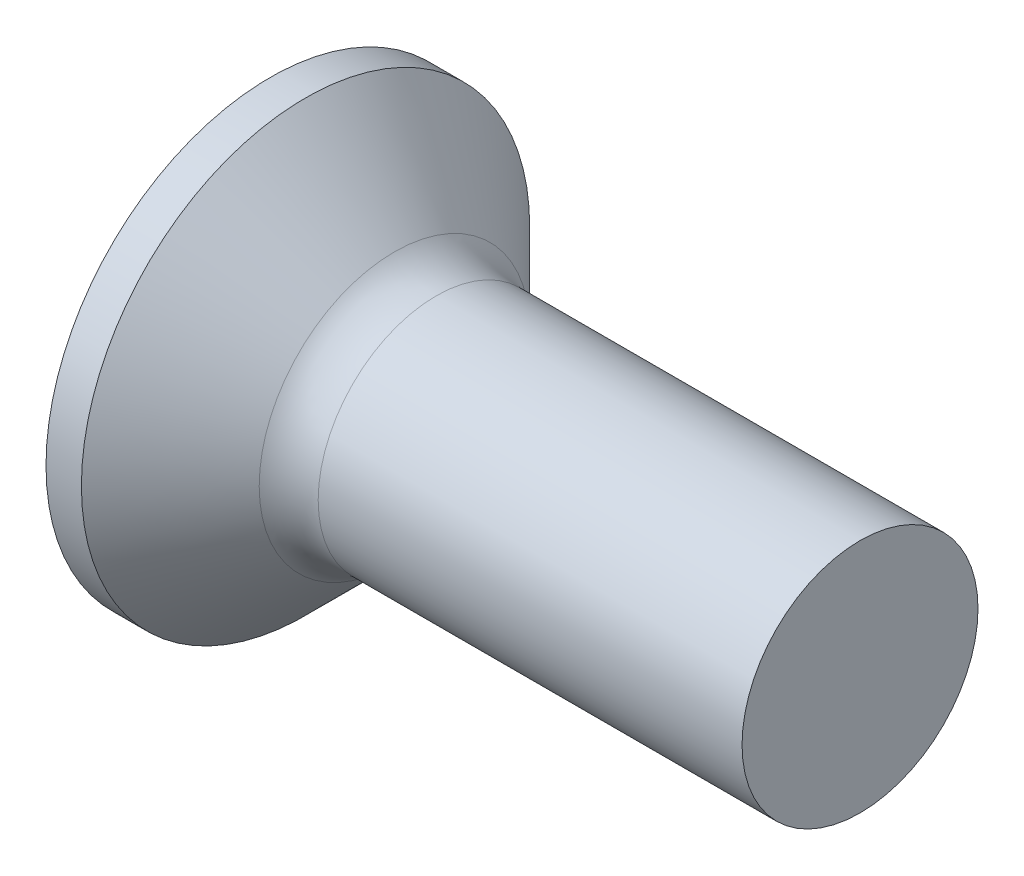
ISO-10303-21;
HEADER;
FILE_DESCRIPTION(('STEP AP214'),'2;1');
FILE_NAME('part.step','',(''),(''),'','','');
FILE_SCHEMA(('AUTOMOTIVE_DESIGN { 1 0 10303 214 1 1 1 1 }'));
ENDSEC;
DATA;
#1=APPLICATION_CONTEXT('core data for automotive mechanical design processes');
#2=APPLICATION_PROTOCOL_DEFINITION('international standard','automotive_design',2000,#1);
#3=PRODUCT_CONTEXT('',#1,'mechanical');
#4=PRODUCT('Part','Part','',(#3));
#5=PRODUCT_RELATED_PRODUCT_CATEGORY('part','',(#4));
#6=PRODUCT_DEFINITION_FORMATION('','',#4);
#7=PRODUCT_DEFINITION_CONTEXT('part definition',#1,'design');
#8=PRODUCT_DEFINITION('design','',#6,#7);
#9=PRODUCT_DEFINITION_SHAPE('','',#8);
#10=(LENGTH_UNIT() NAMED_UNIT(*) SI_UNIT(.MILLI.,.METRE.));
#11=(NAMED_UNIT(*) PLANE_ANGLE_UNIT() SI_UNIT($,.RADIAN.));
#12=(NAMED_UNIT(*) SI_UNIT($,.STERADIAN.) SOLID_ANGLE_UNIT());
#13=UNCERTAINTY_MEASURE_WITH_UNIT(LENGTH_MEASURE(1.E-05),#10,'distance_accuracy_value','');
#14=(GEOMETRIC_REPRESENTATION_CONTEXT(3) GLOBAL_UNCERTAINTY_ASSIGNED_CONTEXT((#13)) GLOBAL_UNIT_ASSIGNED_CONTEXT((#10,
#11,#12)) REPRESENTATION_CONTEXT('',''));
#15=CARTESIAN_POINT('',(0.,0.,0.));
#16=DIRECTION('',(0.,0.,1.));
#17=DIRECTION('',(1.,0.,0.));
#18=AXIS2_PLACEMENT_3D('',#15,#16,#17);
#19=CARTESIAN_POINT('',(0.,0.,0.));
#20=DIRECTION('',(-1.,0.,0.));
#21=DIRECTION('',(0.,0.,1.));
#22=AXIS2_PLACEMENT_3D('',#19,#20,#21);
#23=PLANE('',#22);
#24=CARTESIAN_POINT('',(0.,0.,0.));
#25=DIRECTION('',(-1.,0.,0.));
#26=DIRECTION('',(0.,0.,1.));
#27=AXIS2_PLACEMENT_3D('',#24,#25,#26);
#28=CIRCLE('',#27,1.9);
#29=CARTESIAN_POINT('',(0.,0.,1.9));
#30=VERTEX_POINT('',#29);
#31=EDGE_CURVE('E350',#30,#30,#28,.T.);
#32=ORIENTED_EDGE('',*,*,#31,.T.);
#33=EDGE_LOOP('',(#32));
#34=FACE_BOUND('',#33,.T.);
#35=DIRECTION('',(0.,0.,-1.));
#36=VECTOR('',#35,1.);
#37=CARTESIAN_POINT('',(0.,-0.240000000000003,0.949999999999999));
#38=LINE('',#37,#36);
#39=CARTESIAN_POINT('',(0.,-0.240000000000003,0.949999999999999));
#40=VERTEX_POINT('',#39);
#41=CARTESIAN_POINT('',(0.,-0.240000000000001,0.368080234393744));
#42=VERTEX_POINT('',#41);
#43=EDGE_CURVE('E388',#40,#42,#38,.T.);
#44=ORIENTED_EDGE('',*,*,#43,.T.);
#45=CARTESIAN_POINT('',(0.,0.,0.));
#46=DIRECTION('',(-1.,0.,0.));
#47=DIRECTION('',(0.,0.,1.));
#48=AXIS2_PLACEMENT_3D('',#45,#46,#47);
#49=CIRCLE('',#48,0.439412174332203);
#50=CARTESIAN_POINT('',(0.,-0.368080234393745,0.24));
#51=VERTEX_POINT('',#50);
#52=EDGE_CURVE('E376',#51,#42,#49,.T.);
#53=ORIENTED_EDGE('',*,*,#52,.F.);
#54=DIRECTION('',(0.,-1.,0.));
#55=VECTOR('',#54,1.);
#56=CARTESIAN_POINT('',(0.,0.95,0.24));
#57=LINE('',#56,#55);
#58=CARTESIAN_POINT('',(0.,-0.95,0.24));
#59=VERTEX_POINT('',#58);
#60=EDGE_CURVE('E435',#51,#59,#57,.T.);
#61=ORIENTED_EDGE('',*,*,#60,.T.);
#62=DIRECTION('',(0.,0.,-1.));
#63=VECTOR('',#62,1.);
#64=CARTESIAN_POINT('',(0.,-0.95,0.24));
#65=LINE('',#64,#63);
#66=CARTESIAN_POINT('',(0.,-0.95,-0.24));
#67=VERTEX_POINT('',#66);
#68=EDGE_CURVE('E347',#59,#67,#65,.T.);
#69=ORIENTED_EDGE('',*,*,#68,.T.);
#70=DIRECTION('',(0.,1.,0.));
#71=VECTOR('',#70,1.);
#72=CARTESIAN_POINT('',(0.,-0.95,-0.24));
#73=LINE('',#72,#71);
#74=CARTESIAN_POINT('',(0.,-0.368080234393745,-0.24));
#75=VERTEX_POINT('',#74);
#76=EDGE_CURVE('E436',#67,#75,#73,.T.);
#77=ORIENTED_EDGE('',*,*,#76,.T.);
#78=CARTESIAN_POINT('',(0.,-0.239999999999999,-0.368080234393746));
#79=VERTEX_POINT('',#78);
#80=EDGE_CURVE('E382',#79,#75,#49,.T.);
#81=ORIENTED_EDGE('',*,*,#80,.F.);
#82=CARTESIAN_POINT('',(0.,-0.239999999999997,-0.950000000000001));
#83=VERTEX_POINT('',#82);
#84=EDGE_CURVE('E397',#79,#83,#38,.T.);
#85=ORIENTED_EDGE('',*,*,#84,.T.);
#86=DIRECTION('',(0.,1.,0.));
#87=VECTOR('',#86,1.);
#88=CARTESIAN_POINT('',(0.,-0.239999999999997,-0.950000000000001));
#89=LINE('',#88,#87);
#90=CARTESIAN_POINT('',(0.,0.240000000000003,-0.949999999999999));
#91=VERTEX_POINT('',#90);
#92=EDGE_CURVE('E396',#83,#91,#89,.T.);
#93=ORIENTED_EDGE('',*,*,#92,.T.);
#94=DIRECTION('',(0.,0.,1.));
#95=VECTOR('',#94,1.);
#96=CARTESIAN_POINT('',(0.,0.240000000000003,-0.949999999999999));
#97=LINE('',#96,#95);
#98=CARTESIAN_POINT('',(0.,0.240000000000001,-0.368080234393745));
#99=VERTEX_POINT('',#98);
#100=EDGE_CURVE('E403',#91,#99,#97,.T.);
#101=ORIENTED_EDGE('',*,*,#100,.T.);
#102=CARTESIAN_POINT('',(0.,0.368080234393745,-0.24));
#103=VERTEX_POINT('',#102);
#104=EDGE_CURVE('E470',#103,#99,#49,.T.);
#105=ORIENTED_EDGE('',*,*,#104,.F.);
#106=CARTESIAN_POINT('',(0.,0.95,-0.24));
#107=VERTEX_POINT('',#106);
#108=EDGE_CURVE('E444',#103,#107,#73,.T.);
#109=ORIENTED_EDGE('',*,*,#108,.T.);
#110=DIRECTION('',(0.,0.,1.));
#111=VECTOR('',#110,1.);
#112=CARTESIAN_POINT('',(0.,0.95,-0.24));
#113=LINE('',#112,#111);
#114=CARTESIAN_POINT('',(0.,0.95,0.24));
#115=VERTEX_POINT('',#114);
#116=EDGE_CURVE('E432',#107,#115,#113,.T.);
#117=ORIENTED_EDGE('',*,*,#116,.T.);
#118=CARTESIAN_POINT('',(0.,0.368080234393745,0.24));
#119=VERTEX_POINT('',#118);
#120=EDGE_CURVE('E437',#115,#119,#57,.T.);
#121=ORIENTED_EDGE('',*,*,#120,.T.);
#122=CARTESIAN_POINT('',(0.,0.239999999999998,0.368080234393746));
#123=VERTEX_POINT('',#122);
#124=EDGE_CURVE('E384',#123,#119,#49,.T.);
#125=ORIENTED_EDGE('',*,*,#124,.F.);
#126=CARTESIAN_POINT('',(0.,0.239999999999996,0.950000000000001));
#127=VERTEX_POINT('',#126);
#128=EDGE_CURVE('E406',#123,#127,#97,.T.);
#129=ORIENTED_EDGE('',*,*,#128,.T.);
#130=DIRECTION('',(0.,-1.,0.));
#131=VECTOR('',#130,1.);
#132=CARTESIAN_POINT('',(0.,0.239999999999996,0.950000000000001));
#133=LINE('',#132,#131);
#134=EDGE_CURVE('E395',#127,#40,#133,.T.);
#135=ORIENTED_EDGE('',*,*,#134,.T.);
#136=EDGE_LOOP('',(#44,#53,#61,#69,#77,#81,#85,#93,#101,#105,#109,#117,#121,#125,#129,#135));
#137=FACE_BOUND('',#136,.T.);
#138=ADVANCED_FACE('F39',(#34,#137),#23,.T.);
#139=CARTESIAN_POINT('',(1.2,-0.351702090980209,0.24));
#140=DIRECTION('',(0.,0.,-1.));
#141=DIRECTION('',(-1.,0.,0.));
#142=AXIS2_PLACEMENT_3D('',#139,#140,#141);
#143=PLANE('',#142);
#144=ORIENTED_EDGE('',*,*,#60,.F.);
#145=CARTESIAN_POINT('',(-0.647693210421637,-0.421114336989891,0.24));
#146=CARTESIAN_POINT('',(-0.514503449539821,-0.410390261082994,0.24));
#147=CARTESIAN_POINT('',(-0.381320940230654,-0.399574318210381,0.24));
#148=CARTESIAN_POINT('',(-0.114973765657541,-0.377686644384344,0.24));
#149=CARTESIAN_POINT('',(0.0181908991048063,-0.366614907333784,0.24));
#150=CARTESIAN_POINT('',(0.284492634007954,-0.344144100394554,0.24));
#151=CARTESIAN_POINT('',(0.417629704159725,-0.332745030636282,0.24));
#152=CARTESIAN_POINT('',(0.683863247577946,-0.309504122508031,0.24));
#153=CARTESIAN_POINT('',(0.816959721458451,-0.297662291208049,0.24));
#154=CARTESIAN_POINT('',(1.04303435438055,-0.277010154534467,0.24));
#155=CARTESIAN_POINT('',(1.13602713245195,-0.268360479226192,0.24));
#156=CARTESIAN_POINT('',(1.32197255819723,-0.250648380041589,0.24));
#157=CARTESIAN_POINT('',(1.41492520622595,-0.241585959893611,0.24));
#158=CARTESIAN_POINT('',(1.60078125425266,-0.222904447218473,0.24));
#159=CARTESIAN_POINT('',(1.69368465086432,-0.213285320435301,0.24));
#160=CARTESIAN_POINT('',(1.87939874419459,-0.193166747195665,0.24));
#161=CARTESIAN_POINT('',(1.97220943766423,-0.182667270910301,0.24));
#162=CARTESIAN_POINT('',(2.0649517678624,-0.171565852393331,0.24));
#163=B_SPLINE_CURVE_WITH_KNOTS('',3,(#145,#146,#147,#148,#149,#150,#151,#152,#153,#154,#155,
#156,#157,#158,#159,#160,#161,#162),.UNSPECIFIED.,.F.,.F.,(4,2,2,2,2,2,2,2,4),(0.,
0.400862588724007,0.801734742325293,1.2026067362345,1.60347233177046,1.88365413960954,
2.16383341704974,2.44402995322111,2.72423598713696),.UNSPECIFIED.);
#164=CARTESIAN_POINT('',(1.2,-0.262259890185288,0.240000000000001));
#165=VERTEX_POINT('',#164);
#166=EDGE_CURVE('E379',#51,#165,#163,.T.);
#167=ORIENTED_EDGE('',*,*,#166,.T.);
#168=DIRECTION('',(0.,-1.,0.));
#169=VECTOR('',#168,1.);
#170=CARTESIAN_POINT('',(1.2,0.351702090980209,0.24));
#171=LINE('',#170,#169);
#172=CARTESIAN_POINT('',(1.2,-0.351702090980209,0.24));
#173=VERTEX_POINT('',#172);
#174=EDGE_CURVE('E451',#165,#173,#171,.T.);
#175=ORIENTED_EDGE('',*,*,#174,.T.);
#176=DIRECTION('',(0.89493436774996,0.446197800778958,0.));
#177=VECTOR('',#176,1.);
#178=CARTESIAN_POINT('',(0.,-0.95,0.24));
#179=LINE('',#178,#177);
#180=EDGE_CURVE('E325',#59,#173,#179,.T.);
#181=ORIENTED_EDGE('',*,*,#180,.F.);
#182=EDGE_LOOP('',(#144,#167,#175,#181));
#183=FACE_BOUND('',#182,.T.);
#184=ADVANCED_FACE('F193',(#183),#143,.T.);
#185=CARTESIAN_POINT('',(1.2,0.351702090980209,0.24));
#186=VERTEX_POINT('',#185);
#187=CARTESIAN_POINT('',(1.2,0.262259890185288,0.240000000000001));
#188=VERTEX_POINT('',#187);
#189=EDGE_CURVE('E334',#186,#188,#171,.T.);
#190=ORIENTED_EDGE('',*,*,#189,.T.);
#191=CARTESIAN_POINT('',(-0.647693210421637,0.421114336989891,0.24));
#192=CARTESIAN_POINT('',(-0.514503449539821,0.410390261082994,0.24));
#193=CARTESIAN_POINT('',(-0.381320940230654,0.399574318210381,0.24));
#194=CARTESIAN_POINT('',(-0.114973765657541,0.377686644384344,0.24));
#195=CARTESIAN_POINT('',(0.0181908991048065,0.366614907333784,0.24));
#196=CARTESIAN_POINT('',(0.284492634007954,0.344144100394554,0.24));
#197=CARTESIAN_POINT('',(0.417629704159725,0.332745030636282,0.24));
#198=CARTESIAN_POINT('',(0.683863247577946,0.309504122508032,0.24));
#199=CARTESIAN_POINT('',(0.816959721458451,0.297662291208049,0.24));
#200=CARTESIAN_POINT('',(1.04303435438055,0.277010154534467,0.24));
#201=CARTESIAN_POINT('',(1.13602713245196,0.268360479226192,0.24));
#202=CARTESIAN_POINT('',(1.32197255819723,0.250648380041589,0.24));
#203=CARTESIAN_POINT('',(1.41492520622595,0.241585959893611,0.24));
#204=CARTESIAN_POINT('',(1.60078125425266,0.222904447218473,0.24));
#205=CARTESIAN_POINT('',(1.69368465086432,0.213285320435301,0.24));
#206=CARTESIAN_POINT('',(1.87939874419459,0.193166747195665,0.24));
#207=CARTESIAN_POINT('',(1.97220943766423,0.182667270910301,0.24));
#208=CARTESIAN_POINT('',(2.0649517678624,0.171565852393331,0.24));
#209=B_SPLINE_CURVE_WITH_KNOTS('',3,(#191,#192,#193,#194,#195,#196,#197,#198,#199,#200,#201,
#202,#203,#204,#205,#206,#207,#208),.UNSPECIFIED.,.F.,.F.,(4,2,2,2,2,2,2,2,4),(0.,
0.400862588724007,0.801734742325293,1.2026067362345,1.60347233177046,1.88365413960954,
2.16383341704974,2.44402995322111,2.72423598713696),.UNSPECIFIED.);
#210=EDGE_CURVE('E253',#188,#119,#209,.F.);
#211=ORIENTED_EDGE('',*,*,#210,.T.);
#212=ORIENTED_EDGE('',*,*,#120,.F.);
#213=DIRECTION('',(0.89493436774996,-0.446197800778958,0.));
#214=VECTOR('',#213,1.);
#215=CARTESIAN_POINT('',(0.,0.95,0.24));
#216=LINE('',#215,#214);
#217=EDGE_CURVE('E62',#115,#186,#216,.T.);
#218=ORIENTED_EDGE('',*,*,#217,.T.);
#219=EDGE_LOOP('',(#190,#211,#212,#218));
#220=FACE_BOUND('',#219,.T.);
#221=ADVANCED_FACE('F198',(#220),#143,.T.);
#222=CARTESIAN_POINT('',(1.2,0.351702090980209,-0.24));
#223=DIRECTION('',(0.,0.,1.));
#224=DIRECTION('',(1.,0.,0.));
#225=AXIS2_PLACEMENT_3D('',#222,#223,#224);
#226=PLANE('',#225);
#227=DIRECTION('',(0.,1.,0.));
#228=VECTOR('',#227,1.);
#229=CARTESIAN_POINT('',(1.2,-0.351702090980209,-0.24));
#230=LINE('',#229,#228);
#231=CARTESIAN_POINT('',(1.2,-0.351702090980209,-0.24));
#232=VERTEX_POINT('',#231);
#233=CARTESIAN_POINT('',(1.2,-0.262259890185288,-0.24));
#234=VERTEX_POINT('',#233);
#235=EDGE_CURVE('E338',#232,#234,#230,.T.);
#236=ORIENTED_EDGE('',*,*,#235,.T.);
#237=CARTESIAN_POINT('',(-0.647693210421637,-0.421114336989891,-0.239999999999999));
#238=CARTESIAN_POINT('',(-0.514503449539821,-0.410390261082994,-0.24));
#239=CARTESIAN_POINT('',(-0.381320940230654,-0.399574318210381,-0.24));
#240=CARTESIAN_POINT('',(-0.114973765657541,-0.377686644384344,-0.24));
#241=CARTESIAN_POINT('',(0.0181908991048066,-0.366614907333785,-0.24));
#242=CARTESIAN_POINT('',(0.284492634007954,-0.344144100394554,-0.24));
#243=CARTESIAN_POINT('',(0.417629704159725,-0.332745030636282,-0.24));
#244=CARTESIAN_POINT('',(0.683863247577946,-0.309504122508032,-0.24));
#245=CARTESIAN_POINT('',(0.816959721458451,-0.297662291208049,-0.24));
#246=CARTESIAN_POINT('',(1.04303435438055,-0.277010154534467,-0.24));
#247=CARTESIAN_POINT('',(1.13602713245196,-0.268360479226193,-0.24));
#248=CARTESIAN_POINT('',(1.32197255819723,-0.250648380041589,-0.24));
#249=CARTESIAN_POINT('',(1.41492520622595,-0.241585959893612,-0.24));
#250=CARTESIAN_POINT('',(1.60078125425266,-0.222904447218473,-0.24));
#251=CARTESIAN_POINT('',(1.69368465086432,-0.213285320435301,-0.24));
#252=CARTESIAN_POINT('',(1.87939874419459,-0.193166747195665,-0.24));
#253=CARTESIAN_POINT('',(1.97220943766423,-0.182667270910301,-0.24));
#254=CARTESIAN_POINT('',(2.0649517678624,-0.171565852393331,-0.24));
#255=B_SPLINE_CURVE_WITH_KNOTS('',3,(#237,#238,#239,#240,#241,#242,#243,#244,#245,#246,#247,
#248,#249,#250,#251,#252,#253,#254),.UNSPECIFIED.,.F.,.F.,(4,2,2,2,2,2,2,2,4),(0.,
0.400862588724007,0.801734742325293,1.2026067362345,1.60347233177046,1.88365413960954,
2.16383341704974,2.44402995322111,2.72423598713696),.UNSPECIFIED.);
#256=EDGE_CURVE('E247',#234,#75,#255,.F.);
#257=ORIENTED_EDGE('',*,*,#256,.T.);
#258=ORIENTED_EDGE('',*,*,#76,.F.);
#259=DIRECTION('',(0.89493436774996,0.446197800778958,0.));
#260=VECTOR('',#259,1.);
#261=CARTESIAN_POINT('',(0.,-0.95,-0.24));
#262=LINE('',#261,#260);
#263=EDGE_CURVE('E446',#67,#232,#262,.T.);
#264=ORIENTED_EDGE('',*,*,#263,.T.);
#265=EDGE_LOOP('',(#236,#257,#258,#264));
#266=FACE_BOUND('',#265,.T.);
#267=ADVANCED_FACE('F233',(#266),#226,.T.);
#268=ORIENTED_EDGE('',*,*,#108,.F.);
#269=CARTESIAN_POINT('',(-0.647693210421637,0.421114336989891,-0.239999999999999));
#270=CARTESIAN_POINT('',(-0.514503449539821,0.410390261082994,-0.24));
#271=CARTESIAN_POINT('',(-0.381320940230654,0.399574318210381,-0.24));
#272=CARTESIAN_POINT('',(-0.114973765657541,0.377686644384344,-0.24));
#273=CARTESIAN_POINT('',(0.0181908991048066,0.366614907333785,-0.24));
#274=CARTESIAN_POINT('',(0.284492634007954,0.344144100394554,-0.24));
#275=CARTESIAN_POINT('',(0.417629704159725,0.332745030636282,-0.24));
#276=CARTESIAN_POINT('',(0.683863247577946,0.309504122508032,-0.24));
#277=CARTESIAN_POINT('',(0.816959721458451,0.297662291208049,-0.24));
#278=CARTESIAN_POINT('',(1.04303435438055,0.277010154534467,-0.24));
#279=CARTESIAN_POINT('',(1.13602713245196,0.268360479226193,-0.24));
#280=CARTESIAN_POINT('',(1.32197255819723,0.250648380041589,-0.24));
#281=CARTESIAN_POINT('',(1.41492520622595,0.241585959893612,-0.24));
#282=CARTESIAN_POINT('',(1.60078125425266,0.222904447218473,-0.24));
#283=CARTESIAN_POINT('',(1.69368465086432,0.213285320435301,-0.24));
#284=CARTESIAN_POINT('',(1.87939874419459,0.193166747195665,-0.24));
#285=CARTESIAN_POINT('',(1.97220943766423,0.182667270910302,-0.24));
#286=CARTESIAN_POINT('',(2.0649517678624,0.171565852393331,-0.24));
#287=B_SPLINE_CURVE_WITH_KNOTS('',3,(#269,#270,#271,#272,#273,#274,#275,#276,#277,#278,#279,
#280,#281,#282,#283,#284,#285,#286),.UNSPECIFIED.,.F.,.F.,(4,2,2,2,2,2,2,2,4),(0.,
0.400862588724007,0.801734742325293,1.2026067362345,1.60347233177046,1.88365413960954,
2.16383341704974,2.44402995322111,2.72423598713696),.UNSPECIFIED.);
#288=CARTESIAN_POINT('',(1.2,0.262259890185288,-0.24));
#289=VERTEX_POINT('',#288);
#290=EDGE_CURVE('E241',#103,#289,#287,.T.);
#291=ORIENTED_EDGE('',*,*,#290,.T.);
#292=CARTESIAN_POINT('',(1.2,0.351702090980209,-0.24));
#293=VERTEX_POINT('',#292);
#294=EDGE_CURVE('E342',#289,#293,#230,.T.);
#295=ORIENTED_EDGE('',*,*,#294,.T.);
#296=DIRECTION('',(0.89493436774996,-0.446197800778958,0.));
#297=VECTOR('',#296,1.);
#298=CARTESIAN_POINT('',(0.,0.95,-0.24));
#299=LINE('',#298,#297);
#300=EDGE_CURVE('E329',#107,#293,#299,.T.);
#301=ORIENTED_EDGE('',*,*,#300,.F.);
#302=EDGE_LOOP('',(#268,#291,#295,#301));
#303=FACE_BOUND('',#302,.T.);
#304=ADVANCED_FACE('F225',(#303),#226,.T.);
#305=CARTESIAN_POINT('',(1.2,-0.351702090980209,-0.24));
#306=DIRECTION('',(-1.,0.,0.));
#307=DIRECTION('',(0.,0.,1.));
#308=AXIS2_PLACEMENT_3D('',#305,#306,#307);
#309=PLANE('',#308);
#310=DIRECTION('',(0.,-1.,0.));
#311=VECTOR('',#310,1.);
#312=CARTESIAN_POINT('',(1.2,0.239999999999999,0.35170209098021));
#313=LINE('',#312,#311);
#314=CARTESIAN_POINT('',(1.2,-0.051825565121353,0.351702090980209));
#315=VERTEX_POINT('',#314);
#316=CARTESIAN_POINT('',(1.2,-0.240000000000001,0.351702090980208));
#317=VERTEX_POINT('',#316);
#318=EDGE_CURVE('E423',#315,#317,#313,.T.);
#319=ORIENTED_EDGE('',*,*,#318,.F.);
#320=CARTESIAN_POINT('',(1.2,0.,0.));
#321=DIRECTION('',(-1.,0.,0.));
#322=DIRECTION('',(0.,0.,1.));
#323=AXIS2_PLACEMENT_3D('',#320,#321,#322);
#324=CIRCLE('',#323,0.355499999999999);
#325=CARTESIAN_POINT('',(1.2,-0.240000000000001,0.262259890185287));
#326=VERTEX_POINT('',#325);
#327=EDGE_CURVE('E54',#326,#315,#324,.T.);
#328=ORIENTED_EDGE('',*,*,#327,.F.);
#329=DIRECTION('',(0.,0.,-1.));
#330=VECTOR('',#329,1.);
#331=CARTESIAN_POINT('',(1.2,-0.240000000000001,0.351702090980208));
#332=LINE('',#331,#330);
#333=EDGE_CURVE('E391',#317,#326,#332,.T.);
#334=ORIENTED_EDGE('',*,*,#333,.F.);
#335=EDGE_LOOP('',(#319,#328,#334));
#336=FACE_BOUND('',#335,.T.);
#337=ADVANCED_FACE('F221',(#336),#309,.T.);
#338=ORIENTED_EDGE('',*,*,#174,.F.);
#339=CARTESIAN_POINT('',(1.2,-0.35170209098021,0.0518255651213549));
#340=VERTEX_POINT('',#339);
#341=EDGE_CURVE('E483',#340,#165,#324,.T.);
#342=ORIENTED_EDGE('',*,*,#341,.F.);
#343=DIRECTION('',(0.,0.,-1.));
#344=VECTOR('',#343,1.);
#345=CARTESIAN_POINT('',(1.2,-0.351702090980209,0.24));
#346=LINE('',#345,#344);
#347=EDGE_CURVE('E320',#173,#340,#346,.T.);
#348=ORIENTED_EDGE('',*,*,#347,.F.);
#349=EDGE_LOOP('',(#338,#342,#348));
#350=FACE_BOUND('',#349,.T.);
#351=ADVANCED_FACE('F224',(#350),#309,.T.);
#352=CARTESIAN_POINT('',(1.2,-0.35170209098021,-0.0518255651213549));
#353=VERTEX_POINT('',#352);
#354=EDGE_CURVE('E330',#353,#232,#346,.T.);
#355=ORIENTED_EDGE('',*,*,#354,.F.);
#356=EDGE_CURVE('E487',#234,#353,#324,.T.);
#357=ORIENTED_EDGE('',*,*,#356,.F.);
#358=ORIENTED_EDGE('',*,*,#235,.F.);
#359=EDGE_LOOP('',(#355,#357,#358));
#360=FACE_BOUND('',#359,.T.);
#361=ADVANCED_FACE('F522',(#360),#309,.T.);
#362=CARTESIAN_POINT('',(1.2,-0.239999999999999,-0.262259890185289));
#363=VERTEX_POINT('',#362);
#364=CARTESIAN_POINT('',(1.2,-0.239999999999999,-0.35170209098021));
#365=VERTEX_POINT('',#364);
#366=EDGE_CURVE('E422',#363,#365,#332,.T.);
#367=ORIENTED_EDGE('',*,*,#366,.F.);
#368=CARTESIAN_POINT('',(1.2,-0.0518255651213534,-0.35170209098021));
#369=VERTEX_POINT('',#368);
#370=EDGE_CURVE('E515',#369,#363,#324,.T.);
#371=ORIENTED_EDGE('',*,*,#370,.F.);
#372=DIRECTION('',(0.,1.,0.));
#373=VECTOR('',#372,1.);
#374=CARTESIAN_POINT('',(1.2,-0.239999999999999,-0.35170209098021));
#375=LINE('',#374,#373);
#376=EDGE_CURVE('E418',#365,#369,#375,.T.);
#377=ORIENTED_EDGE('',*,*,#376,.F.);
#378=EDGE_LOOP('',(#367,#371,#377));
#379=FACE_BOUND('',#378,.T.);
#380=ADVANCED_FACE('F524',(#379),#309,.T.);
#381=CARTESIAN_POINT('',(1.2,0.0518255651213558,-0.351702090980209));
#382=VERTEX_POINT('',#381);
#383=CARTESIAN_POINT('',(1.2,0.240000000000001,-0.351702090980209));
#384=VERTEX_POINT('',#383);
#385=EDGE_CURVE('E425',#382,#384,#375,.T.);
#386=ORIENTED_EDGE('',*,*,#385,.F.);
#387=CARTESIAN_POINT('',(1.2,0.240000000000001,-0.262259890185287));
#388=VERTEX_POINT('',#387);
#389=EDGE_CURVE('E509',#388,#382,#324,.T.);
#390=ORIENTED_EDGE('',*,*,#389,.F.);
#391=DIRECTION('',(0.,0.,1.));
#392=VECTOR('',#391,1.);
#393=CARTESIAN_POINT('',(1.2,0.240000000000001,-0.351702090980209));
#394=LINE('',#393,#392);
#395=EDGE_CURVE('E428',#384,#388,#394,.T.);
#396=ORIENTED_EDGE('',*,*,#395,.F.);
#397=EDGE_LOOP('',(#386,#390,#396));
#398=FACE_BOUND('',#397,.T.);
#399=ADVANCED_FACE('F529',(#398),#309,.T.);
#400=ORIENTED_EDGE('',*,*,#294,.F.);
#401=CARTESIAN_POINT('',(1.2,0.351702090980209,-0.0518255651213562));
#402=VERTEX_POINT('',#401);
#403=EDGE_CURVE('E468',#402,#289,#324,.T.);
#404=ORIENTED_EDGE('',*,*,#403,.F.);
#405=DIRECTION('',(0.,0.,1.));
#406=VECTOR('',#405,1.);
#407=CARTESIAN_POINT('',(1.2,0.351702090980209,-0.24));
#408=LINE('',#407,#406);
#409=EDGE_CURVE('E449',#293,#402,#408,.T.);
#410=ORIENTED_EDGE('',*,*,#409,.F.);
#411=EDGE_LOOP('',(#400,#404,#410));
#412=FACE_BOUND('',#411,.T.);
#413=ADVANCED_FACE('F505',(#412),#309,.T.);
#414=CARTESIAN_POINT('',(1.2,0.351702090980209,0.0518255651213561));
#415=VERTEX_POINT('',#414);
#416=EDGE_CURVE('E341',#415,#186,#408,.T.);
#417=ORIENTED_EDGE('',*,*,#416,.F.);
#418=EDGE_CURVE('E462',#188,#415,#324,.T.);
#419=ORIENTED_EDGE('',*,*,#418,.F.);
#420=ORIENTED_EDGE('',*,*,#189,.F.);
#421=EDGE_LOOP('',(#417,#419,#420));
#422=FACE_BOUND('',#421,.T.);
#423=ADVANCED_FACE('F314',(#422),#309,.T.);
#424=CARTESIAN_POINT('',(1.2,0.239999999999999,0.262259890185289));
#425=VERTEX_POINT('',#424);
#426=CARTESIAN_POINT('',(1.2,0.239999999999999,0.35170209098021));
#427=VERTEX_POINT('',#426);
#428=EDGE_CURVE('E431',#425,#427,#394,.T.);
#429=ORIENTED_EDGE('',*,*,#428,.F.);
#430=CARTESIAN_POINT('',(1.2,0.0518255651213545,0.35170209098021));
#431=VERTEX_POINT('',#430);
#432=EDGE_CURVE('E383',#431,#425,#324,.T.);
#433=ORIENTED_EDGE('',*,*,#432,.F.);
#434=EDGE_CURVE('E419',#427,#431,#313,.T.);
#435=ORIENTED_EDGE('',*,*,#434,.F.);
#436=EDGE_LOOP('',(#429,#433,#435));
#437=FACE_BOUND('',#436,.T.);
#438=ADVANCED_FACE('F227',(#437),#309,.T.);
#439=CARTESIAN_POINT('',(1.2,-0.351702090980209,-0.24));
#440=DIRECTION('',(-0.446197800778958,0.894934367749961,0.));
#441=DIRECTION('',(-0.89493436774996,-0.446197800778958,0.));
#442=AXIS2_PLACEMENT_3D('',#439,#440,#441);
#443=PLANE('',#442);
#444=ORIENTED_EDGE('',*,*,#347,.T.);
#445=CARTESIAN_POINT('',(1.81755030037573,-0.0438028797890923,0.));
#446=DIRECTION('',(-0.446197800778958,0.894934367749961,0.));
#447=DIRECTION('',(-0.89493436774996,-0.446197800778958,0.));
#448=AXIS2_PLACEMENT_3D('',#445,#446,#447);
#449=ELLIPSE('',#448,0.699951178008363,0.309229710740658);
#450=EDGE_CURVE('E321',#340,#353,#449,.F.);
#451=ORIENTED_EDGE('',*,*,#450,.T.);
#452=ORIENTED_EDGE('',*,*,#354,.T.);
#453=ORIENTED_EDGE('',*,*,#263,.F.);
#454=ORIENTED_EDGE('',*,*,#68,.F.);
#455=ORIENTED_EDGE('',*,*,#180,.T.);
#456=EDGE_LOOP('',(#444,#451,#452,#453,#454,#455));
#457=FACE_BOUND('',#456,.T.);
#458=ADVANCED_FACE('F232',(#457),#443,.T.);
#459=CARTESIAN_POINT('',(1.2,0.351702090980209,0.24));
#460=DIRECTION('',(-0.446197800778958,-0.89493436774996,0.));
#461=DIRECTION('',(0.89493436774996,-0.446197800778958,0.));
#462=AXIS2_PLACEMENT_3D('',#459,#460,#461);
#463=PLANE('',#462);
#464=ORIENTED_EDGE('',*,*,#409,.T.);
#465=CARTESIAN_POINT('',(1.81755030037572,0.0438028797890929,0.));
#466=DIRECTION('',(-0.446197800778958,-0.89493436774996,0.));
#467=DIRECTION('',(-0.89493436774996,0.446197800778958,0.));
#468=AXIS2_PLACEMENT_3D('',#465,#466,#467);
#469=ELLIPSE('',#468,0.699951178008361,0.309229710740658);
#470=EDGE_CURVE('E294',#402,#415,#469,.F.);
#471=ORIENTED_EDGE('',*,*,#470,.T.);
#472=ORIENTED_EDGE('',*,*,#416,.T.);
#473=ORIENTED_EDGE('',*,*,#217,.F.);
#474=ORIENTED_EDGE('',*,*,#116,.F.);
#475=ORIENTED_EDGE('',*,*,#300,.T.);
#476=EDGE_LOOP('',(#464,#471,#472,#473,#474,#475));
#477=FACE_BOUND('',#476,.T.);
#478=ADVANCED_FACE('F228',(#477),#463,.T.);
#479=CARTESIAN_POINT('',(1.2,-0.239999999999999,-0.35170209098021));
#480=DIRECTION('',(0.,1.,0.));
#481=DIRECTION('',(-1.,0.,0.));
#482=AXIS2_PLACEMENT_3D('',#479,#480,#481);
#483=PLANE('',#482);
#484=ORIENTED_EDGE('',*,*,#84,.F.);
#485=CARTESIAN_POINT('',(-0.647693210410766,-0.239999999999999,-0.421114336989017));
#486=CARTESIAN_POINT('',(-0.514503449530112,-0.239999999999999,-0.410390261082207));
#487=CARTESIAN_POINT('',(-0.381320940222106,-0.239999999999999,-0.399574318209684));
#488=CARTESIAN_POINT('',(-0.114973765651316,-0.239999999999999,-0.377686644383828));
#489=CARTESIAN_POINT('',(0.01819089910987,-0.239999999999999,-0.366614907333361));
#490=CARTESIAN_POINT('',(0.284492634009302,-0.239999999999999,-0.344144100394438));
#491=CARTESIAN_POINT('',(0.417629704158519,-0.239999999999999,-0.332745030636383));
#492=CARTESIAN_POINT('',(0.683863247571635,-0.239999999999999,-0.309504122508587));
#493=CARTESIAN_POINT('',(0.816959721449588,-0.239999999999999,-0.297662291208841));
#494=CARTESIAN_POINT('',(1.04303435436914,-0.239999999999999,-0.277010154535523));
#495=CARTESIAN_POINT('',(1.13602713244054,-0.239999999999999,-0.268360479227263));
#496=CARTESIAN_POINT('',(1.32197255818582,-0.239999999999999,-0.250648380042693));
#497=CARTESIAN_POINT('',(1.41492520621454,-0.239999999999999,-0.241585959894735));
#498=CARTESIAN_POINT('',(1.60078125424125,-0.239999999999999,-0.222904447219644));
#499=CARTESIAN_POINT('',(1.69368465085292,-0.239999999999999,-0.213285320436499));
#500=CARTESIAN_POINT('',(1.8793987441832,-0.24,-0.193166747196935));
#501=CARTESIAN_POINT('',(1.97220943765284,-0.24,-0.182667270911615));
#502=CARTESIAN_POINT('',(2.06495176785102,-0.24,-0.171565852394701));
#503=B_SPLINE_CURVE_WITH_KNOTS('',3,(#485,#486,#487,#488,#489,#490,#491,#492,#493,#494,#495,
#496,#497,#498,#499,#500,#501,#502),.UNSPECIFIED.,.F.,.F.,(4,2,2,2,2,2,2,2,4),(0.,
0.400862588720512,0.801734742318303,1.20260673621982,1.60347233174809,1.88365413958718,
2.16383341702737,2.44402995319874,2.72423598711459),.UNSPECIFIED.);
#504=EDGE_CURVE('E287',#79,#363,#503,.T.);
#505=ORIENTED_EDGE('',*,*,#504,.T.);
#506=ORIENTED_EDGE('',*,*,#366,.T.);
#507=DIRECTION('',(0.89493436774996,0.,0.446197800778958));
#508=VECTOR('',#507,1.);
#509=CARTESIAN_POINT('',(0.,-0.239999999999997,-0.950000000000001));
#510=LINE('',#509,#508);
#511=EDGE_CURVE('E407',#83,#365,#510,.T.);
#512=ORIENTED_EDGE('',*,*,#511,.F.);
#513=EDGE_LOOP('',(#484,#505,#506,#512));
#514=FACE_BOUND('',#513,.T.);
#515=ADVANCED_FACE('F231',(#514),#483,.T.);
#516=CARTESIAN_POINT('',(1.2,0.239999999999999,0.35170209098021));
#517=DIRECTION('',(0.,-1.,0.));
#518=DIRECTION('',(1.,0.,0.));
#519=AXIS2_PLACEMENT_3D('',#516,#517,#518);
#520=PLANE('',#519);
#521=ORIENTED_EDGE('',*,*,#395,.T.);
#522=CARTESIAN_POINT('',(-0.647693210421637,0.240000000000001,-0.42111433698989));
#523=CARTESIAN_POINT('',(-0.514503449539821,0.240000000000001,-0.410390261082993));
#524=CARTESIAN_POINT('',(-0.381320940230654,0.240000000000001,-0.399574318210381));
#525=CARTESIAN_POINT('',(-0.114973765657541,0.240000000000001,-0.377686644384343));
#526=CARTESIAN_POINT('',(0.0181908991048065,0.240000000000001,-0.366614907333784));
#527=CARTESIAN_POINT('',(0.284492634007954,0.240000000000001,-0.344144100394553));
#528=CARTESIAN_POINT('',(0.417629704159725,0.240000000000001,-0.332745030636281));
#529=CARTESIAN_POINT('',(0.683863247577946,0.240000000000001,-0.309504122508031));
#530=CARTESIAN_POINT('',(0.816959721458451,0.240000000000001,-0.297662291208048));
#531=CARTESIAN_POINT('',(1.04303435438055,0.240000000000001,-0.277010154534467));
#532=CARTESIAN_POINT('',(1.13602713245196,0.240000000000001,-0.268360479226192));
#533=CARTESIAN_POINT('',(1.32197255819723,0.240000000000001,-0.250648380041588));
#534=CARTESIAN_POINT('',(1.41492520622595,0.240000000000001,-0.241585959893611));
#535=CARTESIAN_POINT('',(1.60078125425266,0.240000000000001,-0.222904447218472));
#536=CARTESIAN_POINT('',(1.69368465086432,0.240000000000001,-0.2132853204353));
#537=CARTESIAN_POINT('',(1.87939874419459,0.240000000000001,-0.193166747195664));
#538=CARTESIAN_POINT('',(1.97220943766423,0.240000000000001,-0.182667270910301));
#539=CARTESIAN_POINT('',(2.0649517678624,0.240000000000001,-0.17156585239333));
#540=B_SPLINE_CURVE_WITH_KNOTS('',3,(#522,#523,#524,#525,#526,#527,#528,#529,#530,#531,#532,
#533,#534,#535,#536,#537,#538,#539),.UNSPECIFIED.,.F.,.F.,(4,2,2,2,2,2,2,2,4),(0.,
0.400862588724007,0.801734742325293,1.2026067362345,1.60347233177046,1.88365413960954,
2.16383341704974,2.44402995322111,2.72423598713696),.UNSPECIFIED.);
#541=EDGE_CURVE('E281',#388,#99,#540,.F.);
#542=ORIENTED_EDGE('',*,*,#541,.T.);
#543=ORIENTED_EDGE('',*,*,#100,.F.);
#544=DIRECTION('',(0.89493436774996,0.,0.446197800778958));
#545=VECTOR('',#544,1.);
#546=CARTESIAN_POINT('',(0.,0.240000000000003,-0.949999999999999));
#547=LINE('',#546,#545);
#548=EDGE_CURVE('E410',#91,#384,#547,.T.);
#549=ORIENTED_EDGE('',*,*,#548,.T.);
#550=EDGE_LOOP('',(#521,#542,#543,#549));
#551=FACE_BOUND('',#550,.T.);
#552=ADVANCED_FACE('F297',(#551),#520,.T.);
#553=CARTESIAN_POINT('',(1.2,0.240000000000001,-0.351702090980209));
#554=DIRECTION('',(-0.446197800778958,0.,0.894934367749961));
#555=DIRECTION('',(-0.89493436774996,0.,-0.446197800778958));
#556=AXIS2_PLACEMENT_3D('',#553,#554,#555);
#557=PLANE('',#556);
#558=ORIENTED_EDGE('',*,*,#376,.T.);
#559=CARTESIAN_POINT('',(1.81755030037573,0.,-0.0438028797890923));
#560=DIRECTION('',(-0.446197800778958,0.,0.894934367749961));
#561=DIRECTION('',(-0.89493436774996,0.,-0.446197800778958));
#562=AXIS2_PLACEMENT_3D('',#559,#560,#561);
#563=ELLIPSE('',#562,0.699951178008363,0.309229710740658);
#564=EDGE_CURVE('E392',#369,#382,#563,.F.);
#565=ORIENTED_EDGE('',*,*,#564,.T.);
#566=ORIENTED_EDGE('',*,*,#385,.T.);
#567=ORIENTED_EDGE('',*,*,#548,.F.);
#568=ORIENTED_EDGE('',*,*,#92,.F.);
#569=ORIENTED_EDGE('',*,*,#511,.T.);
#570=EDGE_LOOP('',(#558,#565,#566,#567,#568,#569));
#571=FACE_BOUND('',#570,.T.);
#572=ADVANCED_FACE('F260',(#571),#557,.T.);
#573=ORIENTED_EDGE('',*,*,#333,.T.);
#574=CARTESIAN_POINT('',(-0.647693210421637,-0.240000000000001,0.42111433698989));
#575=CARTESIAN_POINT('',(-0.514503449539821,-0.240000000000001,0.410390261082993));
#576=CARTESIAN_POINT('',(-0.381320940230654,-0.240000000000001,0.39957431821038));
#577=CARTESIAN_POINT('',(-0.114973765657541,-0.240000000000001,0.377686644384343));
#578=CARTESIAN_POINT('',(0.0181908991048062,-0.240000000000001,0.366614907333784));
#579=CARTESIAN_POINT('',(0.284492634007953,-0.240000000000001,0.344144100394553));
#580=CARTESIAN_POINT('',(0.417629704159725,-0.240000000000001,0.332745030636281));
#581=CARTESIAN_POINT('',(0.683863247577946,-0.240000000000001,0.309504122508031));
#582=CARTESIAN_POINT('',(0.816959721458451,-0.240000000000001,0.297662291208048));
#583=CARTESIAN_POINT('',(1.04303435438055,-0.240000000000001,0.277010154534466));
#584=CARTESIAN_POINT('',(1.13602713245196,-0.240000000000001,0.268360479226192));
#585=CARTESIAN_POINT('',(1.32197255819723,-0.240000000000001,0.250648380041588));
#586=CARTESIAN_POINT('',(1.41492520622595,-0.240000000000001,0.241585959893611));
#587=CARTESIAN_POINT('',(1.60078125425266,-0.240000000000001,0.222904447218472));
#588=CARTESIAN_POINT('',(1.69368465086432,-0.240000000000001,0.2132853204353));
#589=CARTESIAN_POINT('',(1.87939874419459,-0.240000000000001,0.193166747195664));
#590=CARTESIAN_POINT('',(1.97220943766423,-0.240000000000001,0.182667270910301));
#591=CARTESIAN_POINT('',(2.0649517678624,-0.240000000000001,0.171565852393331));
#592=B_SPLINE_CURVE_WITH_KNOTS('',3,(#574,#575,#576,#577,#578,#579,#580,#581,#582,#583,#584,
#585,#586,#587,#588,#589,#590,#591),.UNSPECIFIED.,.F.,.F.,(4,2,2,2,2,2,2,2,4),(0.,
0.400862588724007,0.801734742325293,1.2026067362345,1.60347233177046,1.88365413960954,
2.16383341704974,2.44402995322111,2.72423598713696),.UNSPECIFIED.);
#593=EDGE_CURVE('E274',#326,#42,#592,.F.);
#594=ORIENTED_EDGE('',*,*,#593,.T.);
#595=ORIENTED_EDGE('',*,*,#43,.F.);
#596=DIRECTION('',(0.89493436774996,0.,-0.446197800778958));
#597=VECTOR('',#596,1.);
#598=CARTESIAN_POINT('',(0.,-0.240000000000003,0.949999999999999));
#599=LINE('',#598,#597);
#600=EDGE_CURVE('E413',#40,#317,#599,.T.);
#601=ORIENTED_EDGE('',*,*,#600,.T.);
#602=EDGE_LOOP('',(#573,#594,#595,#601));
#603=FACE_BOUND('',#602,.T.);
#604=ADVANCED_FACE('F299',(#603),#483,.T.);
#605=ORIENTED_EDGE('',*,*,#128,.F.);
#606=CARTESIAN_POINT('',(-0.647693210410766,0.239999999999998,0.421114336989017));
#607=CARTESIAN_POINT('',(-0.514503449530112,0.239999999999998,0.410390261082208));
#608=CARTESIAN_POINT('',(-0.381320940222106,0.239999999999998,0.399574318209684));
#609=CARTESIAN_POINT('',(-0.114973765651316,0.239999999999998,0.377686644383829));
#610=CARTESIAN_POINT('',(0.0181908991098697,0.239999999999998,0.366614907333361));
#611=CARTESIAN_POINT('',(0.284492634009302,0.239999999999999,0.344144100394438));
#612=CARTESIAN_POINT('',(0.417629704158519,0.239999999999999,0.332745030636384));
#613=CARTESIAN_POINT('',(0.683863247571635,0.239999999999999,0.309504122508588));
#614=CARTESIAN_POINT('',(0.816959721449588,0.239999999999999,0.297662291208841));
#615=CARTESIAN_POINT('',(1.04303435436914,0.239999999999999,0.277010154535524));
#616=CARTESIAN_POINT('',(1.13602713244054,0.239999999999999,0.268360479227263));
#617=CARTESIAN_POINT('',(1.32197255818582,0.239999999999999,0.250648380042694));
#618=CARTESIAN_POINT('',(1.41492520621454,0.239999999999999,0.241585959894736));
#619=CARTESIAN_POINT('',(1.60078125424125,0.239999999999999,0.222904447219644));
#620=CARTESIAN_POINT('',(1.69368465085292,0.239999999999999,0.213285320436499));
#621=CARTESIAN_POINT('',(1.8793987441832,0.239999999999999,0.193166747196935));
#622=CARTESIAN_POINT('',(1.97220943765284,0.24,0.182667270911615));
#623=CARTESIAN_POINT('',(2.06495176785102,0.24,0.171565852394701));
#624=B_SPLINE_CURVE_WITH_KNOTS('',3,(#606,#607,#608,#609,#610,#611,#612,#613,#614,#615,#616,
#617,#618,#619,#620,#621,#622,#623),.UNSPECIFIED.,.F.,.F.,(4,2,2,2,2,2,2,2,4),(0.,
0.400862588720512,0.801734742318303,1.20260673621982,1.60347233174809,1.88365413958718,
2.16383341702737,2.44402995319874,2.72423598711459),.UNSPECIFIED.);
#625=EDGE_CURVE('E265',#123,#425,#624,.T.);
#626=ORIENTED_EDGE('',*,*,#625,.T.);
#627=ORIENTED_EDGE('',*,*,#428,.T.);
#628=DIRECTION('',(0.89493436774996,0.,-0.446197800778958));
#629=VECTOR('',#628,1.);
#630=CARTESIAN_POINT('',(0.,0.239999999999996,0.950000000000001));
#631=LINE('',#630,#629);
#632=EDGE_CURVE('E415',#127,#427,#631,.T.);
#633=ORIENTED_EDGE('',*,*,#632,.F.);
#634=EDGE_LOOP('',(#605,#626,#627,#633));
#635=FACE_BOUND('',#634,.T.);
#636=ADVANCED_FACE('F305',(#635),#520,.T.);
#637=CARTESIAN_POINT('',(1.2,-0.240000000000001,0.351702090980208));
#638=DIRECTION('',(-0.446197800778958,0.,-0.89493436774996));
#639=DIRECTION('',(0.89493436774996,0.,-0.446197800778958));
#640=AXIS2_PLACEMENT_3D('',#637,#638,#639);
#641=PLANE('',#640);
#642=ORIENTED_EDGE('',*,*,#434,.T.);
#643=CARTESIAN_POINT('',(1.81755030037572,0.,0.0438028797890929));
#644=DIRECTION('',(-0.446197800778958,0.,-0.89493436774996));
#645=DIRECTION('',(-0.89493436774996,0.,0.446197800778958));
#646=AXIS2_PLACEMENT_3D('',#643,#644,#645);
#647=ELLIPSE('',#646,0.699951178008361,0.309229710740658);
#648=EDGE_CURVE('E11',#431,#315,#647,.F.);
#649=ORIENTED_EDGE('',*,*,#648,.T.);
#650=ORIENTED_EDGE('',*,*,#318,.T.);
#651=ORIENTED_EDGE('',*,*,#600,.F.);
#652=ORIENTED_EDGE('',*,*,#134,.F.);
#653=ORIENTED_EDGE('',*,*,#632,.T.);
#654=EDGE_LOOP('',(#642,#649,#650,#651,#652,#653));
#655=FACE_BOUND('',#654,.T.);
#656=ADVANCED_FACE('F208',(#655),#641,.T.);
#657=CARTESIAN_POINT('',(-6.34999999999999,0.,0.));
#658=DIRECTION('',(-1.,0.,0.));
#659=DIRECTION('',(0.,0.,1.));
#660=AXIS2_PLACEMENT_3D('',#657,#658,#659);
#661=CYLINDRICAL_SURFACE('',#660,1.9);
#662=CARTESIAN_POINT('',(0.300000000000004,0.,0.));
#663=DIRECTION('',(-1.,0.,0.));
#664=DIRECTION('',(0.,0.,1.));
#665=AXIS2_PLACEMENT_3D('',#662,#663,#664);
#666=CIRCLE('',#665,1.9);
#667=CARTESIAN_POINT('',(0.300000000000004,0.,1.9));
#668=VERTEX_POINT('',#667);
#669=EDGE_CURVE('E346',#668,#668,#666,.T.);
#670=ORIENTED_EDGE('',*,*,#669,.T.);
#671=EDGE_LOOP('',(#670));
#672=FACE_BOUND('',#671,.T.);
#673=ORIENTED_EDGE('',*,*,#31,.F.);
#674=EDGE_LOOP('',(#673));
#675=FACE_BOUND('',#674,.T.);
#676=ADVANCED_FACE('F204',(#672,#675),#661,.T.);
#677=CARTESIAN_POINT('',(0.300000000000004,0.,0.));
#678=DIRECTION('',(-1.,0.,0.));
#679=DIRECTION('',(0.,0.,1.));
#680=AXIS2_PLACEMENT_3D('',#677,#678,#679);
#681=CONICAL_SURFACE('',#680,1.9,0.785398163397451);
#682=CARTESIAN_POINT('',(1.05355339059327,0.,0.));
#683=DIRECTION('',(-1.,0.,0.));
#684=DIRECTION('',(0.,0.,1.));
#685=AXIS2_PLACEMENT_3D('',#682,#683,#684);
#686=CIRCLE('',#685,1.14644660940673);
#687=CARTESIAN_POINT('',(1.05355339059327,0.,1.14644660940673));
#688=VERTEX_POINT('',#687);
#689=EDGE_CURVE('E352',#688,#688,#686,.T.);
#690=ORIENTED_EDGE('',*,*,#689,.T.);
#691=EDGE_LOOP('',(#690));
#692=FACE_BOUND('',#691,.T.);
#693=ORIENTED_EDGE('',*,*,#669,.F.);
#694=EDGE_LOOP('',(#693));
#695=FACE_BOUND('',#694,.T.);
#696=ADVANCED_FACE('F207',(#692,#695),#681,.T.);
#697=CARTESIAN_POINT('',(-6.34999999999999,0.,0.));
#698=DIRECTION('',(-1.,0.,0.));
#699=DIRECTION('',(0.,0.,1.));
#700=AXIS2_PLACEMENT_3D('',#697,#698,#699);
#701=CYLINDRICAL_SURFACE('',#700,1.);
#702=CARTESIAN_POINT('',(1.40710678118655,0.,0.));
#703=DIRECTION('',(-1.,0.,0.));
#704=DIRECTION('',(0.,0.,1.));
#705=AXIS2_PLACEMENT_3D('',#702,#703,#704);
#706=CIRCLE('',#705,1.);
#707=CARTESIAN_POINT('',(1.40710678118655,0.,1.));
#708=VERTEX_POINT('',#707);
#709=EDGE_CURVE('E47',#708,#708,#706,.F.);
#710=ORIENTED_EDGE('',*,*,#709,.T.);
#711=EDGE_LOOP('',(#710));
#712=FACE_BOUND('',#711,.T.);
#713=CARTESIAN_POINT('',(5.,0.,0.));
#714=DIRECTION('',(-1.,0.,0.));
#715=DIRECTION('',(0.,0.,1.));
#716=AXIS2_PLACEMENT_3D('',#713,#714,#715);
#717=CIRCLE('',#716,1.);
#718=CARTESIAN_POINT('',(5.,0.,1.));
#719=VERTEX_POINT('',#718);
#720=EDGE_CURVE('E343',#719,#719,#717,.T.);
#721=ORIENTED_EDGE('',*,*,#720,.T.);
#722=EDGE_LOOP('',(#721));
#723=FACE_BOUND('',#722,.T.);
#724=ADVANCED_FACE('F212',(#712,#723),#701,.T.);
#725=CARTESIAN_POINT('',(5.,1.,0.));
#726=DIRECTION('',(1.,0.,0.));
#727=DIRECTION('',(0.,0.,-1.));
#728=AXIS2_PLACEMENT_3D('',#725,#726,#727);
#729=PLANE('',#728);
#730=ORIENTED_EDGE('',*,*,#720,.F.);
#731=EDGE_LOOP('',(#730));
#732=FACE_BOUND('',#731,.T.);
#733=ADVANCED_FACE('F216',(#732),#729,.T.);
#734=CARTESIAN_POINT('',(1.40710678118655,0.,0.));
#735=DIRECTION('',(-1.,0.,0.));
#736=DIRECTION('',(0.,0.,1.));
#737=AXIS2_PLACEMENT_3D('',#734,#735,#736);
#738=TOROIDAL_SURFACE('',#737,1.5,0.5);
#739=ORIENTED_EDGE('',*,*,#709,.F.);
#740=EDGE_LOOP('',(#739));
#741=FACE_BOUND('',#740,.T.);
#742=ORIENTED_EDGE('',*,*,#689,.F.);
#743=EDGE_LOOP('',(#742));
#744=FACE_BOUND('',#743,.T.);
#745=ADVANCED_FACE('F41',(#741,#744),#738,.F.);
#746=CARTESIAN_POINT('',(1.2,0.,0.));
#747=DIRECTION('',(-1.,0.,0.));
#748=DIRECTION('',(0.,0.,1.));
#749=AXIS2_PLACEMENT_3D('',#746,#747,#748);
#750=CONICAL_SURFACE('',#749,0.355499999999999,0.069813170079766);
#751=ORIENTED_EDGE('',*,*,#52,.T.);
#752=ORIENTED_EDGE('',*,*,#593,.F.);
#753=EDGE_CURVE('E486',#165,#326,#324,.T.);
#754=ORIENTED_EDGE('',*,*,#753,.F.);
#755=ORIENTED_EDGE('',*,*,#166,.F.);
#756=EDGE_LOOP('',(#751,#752,#754,#755));
#757=FACE_BOUND('',#756,.T.);
#758=ADVANCED_FACE('F190',(#757),#750,.F.);
#759=EDGE_CURVE('E465',#425,#188,#324,.T.);
#760=ORIENTED_EDGE('',*,*,#759,.F.);
#761=ORIENTED_EDGE('',*,*,#625,.F.);
#762=ORIENTED_EDGE('',*,*,#124,.T.);
#763=ORIENTED_EDGE('',*,*,#210,.F.);
#764=EDGE_LOOP('',(#760,#761,#762,#763));
#765=FACE_BOUND('',#764,.T.);
#766=ADVANCED_FACE('F368',(#765),#750,.F.);
#767=EDGE_CURVE('E518',#363,#234,#324,.T.);
#768=ORIENTED_EDGE('',*,*,#767,.F.);
#769=ORIENTED_EDGE('',*,*,#504,.F.);
#770=ORIENTED_EDGE('',*,*,#80,.T.);
#771=ORIENTED_EDGE('',*,*,#256,.F.);
#772=EDGE_LOOP('',(#768,#769,#770,#771));
#773=FACE_BOUND('',#772,.T.);
#774=ADVANCED_FACE('F373',(#773),#750,.F.);
#775=ORIENTED_EDGE('',*,*,#104,.T.);
#776=ORIENTED_EDGE('',*,*,#541,.F.);
#777=EDGE_CURVE('E508',#289,#388,#324,.T.);
#778=ORIENTED_EDGE('',*,*,#777,.F.);
#779=ORIENTED_EDGE('',*,*,#290,.F.);
#780=EDGE_LOOP('',(#775,#776,#778,#779));
#781=FACE_BOUND('',#780,.T.);
#782=ADVANCED_FACE('F705',(#781),#750,.F.);
#783=EDGE_CURVE('E485',#353,#340,#324,.T.);
#784=ORIENTED_EDGE('',*,*,#783,.F.);
#785=ORIENTED_EDGE('',*,*,#450,.F.);
#786=EDGE_LOOP('',(#784,#785));
#787=FACE_BOUND('',#786,.T.);
#788=ADVANCED_FACE('F707',(#787),#750,.F.);
#789=EDGE_CURVE('E466',#415,#402,#324,.T.);
#790=ORIENTED_EDGE('',*,*,#789,.F.);
#791=ORIENTED_EDGE('',*,*,#470,.F.);
#792=EDGE_LOOP('',(#790,#791));
#793=FACE_BOUND('',#792,.T.);
#794=ADVANCED_FACE('F712',(#793),#750,.F.);
#795=EDGE_CURVE('E512',#382,#369,#324,.T.);
#796=ORIENTED_EDGE('',*,*,#795,.F.);
#797=ORIENTED_EDGE('',*,*,#564,.F.);
#798=EDGE_LOOP('',(#796,#797));
#799=FACE_BOUND('',#798,.T.);
#800=ADVANCED_FACE('F187',(#799),#750,.F.);
#801=EDGE_CURVE('E469',#315,#431,#324,.T.);
#802=ORIENTED_EDGE('',*,*,#801,.F.);
#803=ORIENTED_EDGE('',*,*,#648,.F.);
#804=EDGE_LOOP('',(#802,#803));
#805=FACE_BOUND('',#804,.T.);
#806=ADVANCED_FACE('F182',(#805),#750,.F.);
#807=CARTESIAN_POINT('',(1.31550895201079,0.,0.));
#808=DIRECTION('',(-1.,0.,0.));
#809=DIRECTION('',(0.,0.,1.));
#810=AXIS2_PLACEMENT_3D('',#807,#808,#809);
#811=CONICAL_SURFACE('',#810,0.,1.25663706143592);
#812=ORIENTED_EDGE('',*,*,#432,.T.);
#813=ORIENTED_EDGE('',*,*,#759,.T.);
#814=ORIENTED_EDGE('',*,*,#418,.T.);
#815=ORIENTED_EDGE('',*,*,#789,.T.);
#816=ORIENTED_EDGE('',*,*,#403,.T.);
#817=ORIENTED_EDGE('',*,*,#777,.T.);
#818=ORIENTED_EDGE('',*,*,#389,.T.);
#819=ORIENTED_EDGE('',*,*,#795,.T.);
#820=ORIENTED_EDGE('',*,*,#370,.T.);
#821=ORIENTED_EDGE('',*,*,#767,.T.);
#822=ORIENTED_EDGE('',*,*,#356,.T.);
#823=ORIENTED_EDGE('',*,*,#783,.T.);
#824=ORIENTED_EDGE('',*,*,#341,.T.);
#825=ORIENTED_EDGE('',*,*,#753,.T.);
#826=ORIENTED_EDGE('',*,*,#327,.T.);
#827=ORIENTED_EDGE('',*,*,#801,.T.);
#828=EDGE_LOOP('',(#812,#813,#814,#815,#816,#817,#818,#819,#820,#821,#822,#823,#824,#825,#826,#827));
#829=FACE_BOUND('',#828,.T.);
#830=CARTESIAN_POINT('',(1.31550895201079,0.,0.));
#831=VERTEX_POINT('',#830);
#832=VERTEX_LOOP('',#831);
#833=FACE_BOUND('',#832,.T.);
#834=ADVANCED_FACE('F180',(#829,#833),#811,.F.);
#835=CLOSED_SHELL('',(#138,#184,#221,#267,#304,#337,#351,#361,#380,#399,#413,#423,#438,#458,
#478,#515,#552,#572,#604,#636,#656,#676,#696,#724,#733,#745,#758,#766,#774,#782,#788,#794,#800,
#806,#834));
#836=MANIFOLD_SOLID_BREP('B2',#835);
#837=ADVANCED_BREP_SHAPE_REPRESENTATION('',(#18,#836),#14);
#838=SHAPE_DEFINITION_REPRESENTATION(#9,#837);
ENDSEC;
END-ISO-10303-21;
